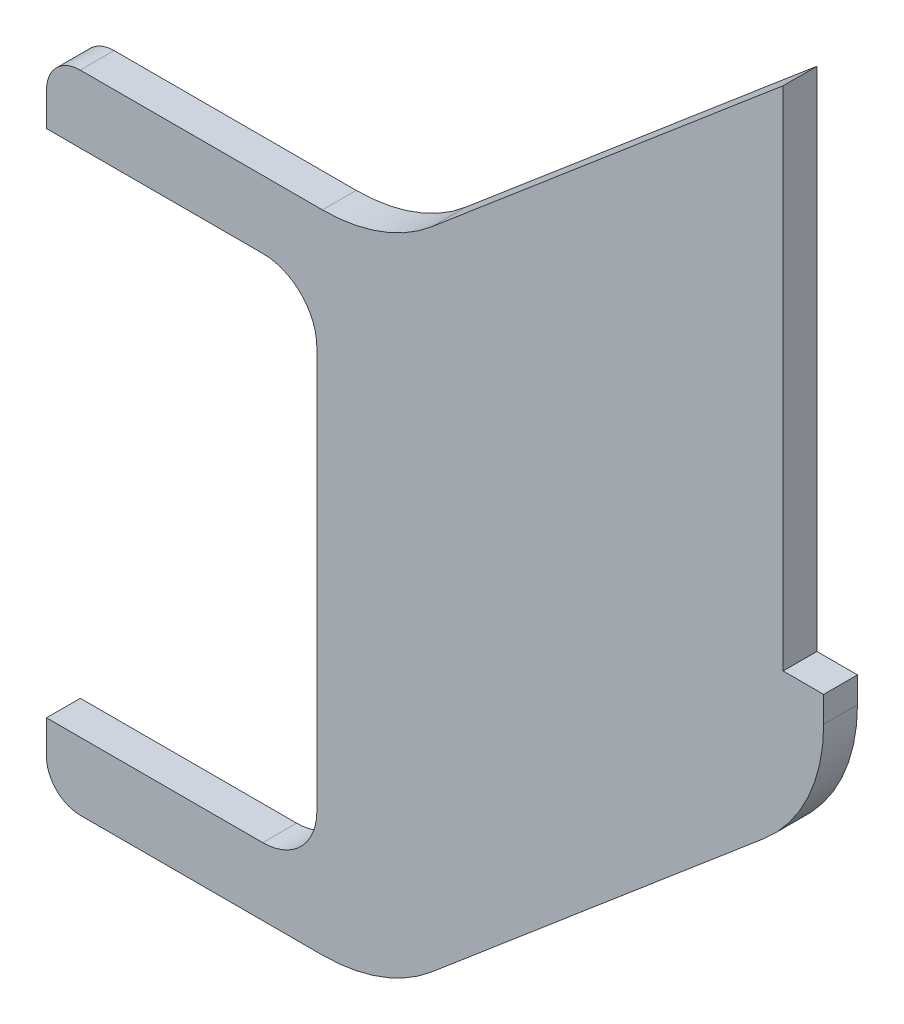
ISO-10303-21;
HEADER;
FILE_DESCRIPTION(('STEP AP214'),'2;1');
FILE_NAME('part.step','',(''),(''),'','','');
FILE_SCHEMA(('AUTOMOTIVE_DESIGN { 1 0 10303 214 1 1 1 1 }'));
ENDSEC;
DATA;
#1=APPLICATION_CONTEXT('core data for automotive mechanical design processes');
#2=APPLICATION_PROTOCOL_DEFINITION('international standard','automotive_design',2000,#1);
#3=PRODUCT_CONTEXT('',#1,'mechanical');
#4=PRODUCT('Part','Part','',(#3));
#5=PRODUCT_RELATED_PRODUCT_CATEGORY('part','',(#4));
#6=PRODUCT_DEFINITION_FORMATION('','',#4);
#7=PRODUCT_DEFINITION_CONTEXT('part definition',#1,'design');
#8=PRODUCT_DEFINITION('design','',#6,#7);
#9=PRODUCT_DEFINITION_SHAPE('','',#8);
#10=(LENGTH_UNIT() NAMED_UNIT(*) SI_UNIT(.MILLI.,.METRE.));
#11=(NAMED_UNIT(*) PLANE_ANGLE_UNIT() SI_UNIT($,.RADIAN.));
#12=(NAMED_UNIT(*) SI_UNIT($,.STERADIAN.) SOLID_ANGLE_UNIT());
#13=UNCERTAINTY_MEASURE_WITH_UNIT(LENGTH_MEASURE(1.E-05),#10,'distance_accuracy_value','');
#14=(GEOMETRIC_REPRESENTATION_CONTEXT(3) GLOBAL_UNCERTAINTY_ASSIGNED_CONTEXT((#13)) GLOBAL_UNIT_ASSIGNED_CONTEXT((#10,
#11,#12)) REPRESENTATION_CONTEXT('',''));
#15=CARTESIAN_POINT('',(0.,0.,0.));
#16=DIRECTION('',(0.,0.,1.));
#17=DIRECTION('',(1.,0.,0.));
#18=AXIS2_PLACEMENT_3D('',#15,#16,#17);
#19=CARTESIAN_POINT('',(0.,171.,10.));
#20=DIRECTION('',(1.,0.,0.));
#21=DIRECTION('',(0.,0.,-1.));
#22=AXIS2_PLACEMENT_3D('',#19,#20,#21);
#23=PLANE('',#22);
#24=DIRECTION('',(0.,-1.,0.));
#25=VECTOR('',#24,1.);
#26=CARTESIAN_POINT('',(0.,171.,10.));
#27=LINE('',#26,#25);
#28=CARTESIAN_POINT('',(0.,181.,10.));
#29=VERTEX_POINT('',#28);
#30=CARTESIAN_POINT('',(0.,171.,10.));
#31=VERTEX_POINT('',#30);
#32=EDGE_CURVE('E168',#29,#31,#27,.T.);
#33=ORIENTED_EDGE('',*,*,#32,.F.);
#34=DIRECTION('',(0.,0.,-1.));
#35=VECTOR('',#34,1.);
#36=CARTESIAN_POINT('',(0.,181.,10.));
#37=LINE('',#36,#35);
#38=CARTESIAN_POINT('',(0.,181.,0.));
#39=VERTEX_POINT('',#38);
#40=EDGE_CURVE('E218',#29,#39,#37,.T.);
#41=ORIENTED_EDGE('',*,*,#40,.T.);
#42=DIRECTION('',(0.,-1.,0.));
#43=VECTOR('',#42,1.);
#44=CARTESIAN_POINT('',(0.,171.,0.));
#45=LINE('',#44,#43);
#46=CARTESIAN_POINT('',(0.,171.,0.));
#47=VERTEX_POINT('',#46);
#48=EDGE_CURVE('E192',#39,#47,#45,.T.);
#49=ORIENTED_EDGE('',*,*,#48,.T.);
#50=DIRECTION('',(0.,0.,-1.));
#51=VECTOR('',#50,1.);
#52=CARTESIAN_POINT('',(0.,171.,10.));
#53=LINE('',#52,#51);
#54=EDGE_CURVE('E186',#31,#47,#53,.T.);
#55=ORIENTED_EDGE('',*,*,#54,.F.);
#56=EDGE_LOOP('',(#33,#41,#49,#55));
#57=FACE_BOUND('',#56,.T.);
#58=ADVANCED_FACE('F34',(#57),#23,.F.);
#59=CARTESIAN_POINT('',(80.,171.,10.));
#60=DIRECTION('',(0.,1.,0.));
#61=DIRECTION('',(0.,0.,1.));
#62=AXIS2_PLACEMENT_3D('',#59,#60,#61);
#63=PLANE('',#62);
#64=DIRECTION('',(1.,0.,0.));
#65=VECTOR('',#64,1.);
#66=CARTESIAN_POINT('',(80.,171.,0.));
#67=LINE('',#66,#65);
#68=CARTESIAN_POINT('',(64.,171.,0.));
#69=VERTEX_POINT('',#68);
#70=EDGE_CURVE('E286',#47,#69,#67,.T.);
#71=ORIENTED_EDGE('',*,*,#70,.T.);
#72=DIRECTION('',(0.,0.,-1.));
#73=VECTOR('',#72,1.);
#74=CARTESIAN_POINT('',(64.,171.,10.));
#75=LINE('',#74,#73);
#76=CARTESIAN_POINT('',(64.,171.,10.));
#77=VERTEX_POINT('',#76);
#78=EDGE_CURVE('E188',#69,#77,#75,.F.);
#79=ORIENTED_EDGE('',*,*,#78,.T.);
#80=DIRECTION('',(1.,0.,0.));
#81=VECTOR('',#80,1.);
#82=CARTESIAN_POINT('',(80.,171.,10.));
#83=LINE('',#82,#81);
#84=EDGE_CURVE('E172',#31,#77,#83,.T.);
#85=ORIENTED_EDGE('',*,*,#84,.F.);
#86=ORIENTED_EDGE('',*,*,#54,.T.);
#87=EDGE_LOOP('',(#71,#79,#85,#86));
#88=FACE_BOUND('',#87,.T.);
#89=ADVANCED_FACE('F185',(#88),#63,.F.);
#90=CARTESIAN_POINT('',(80.,20.,10.));
#91=DIRECTION('',(1.,0.,0.));
#92=DIRECTION('',(0.,0.,-1.));
#93=AXIS2_PLACEMENT_3D('',#90,#91,#92);
#94=PLANE('',#93);
#95=DIRECTION('',(0.,-1.,0.));
#96=VECTOR('',#95,1.);
#97=CARTESIAN_POINT('',(80.,20.,10.));
#98=LINE('',#97,#96);
#99=CARTESIAN_POINT('',(80.,155.,10.));
#100=VERTEX_POINT('',#99);
#101=CARTESIAN_POINT('',(80.,36.,10.));
#102=VERTEX_POINT('',#101);
#103=EDGE_CURVE('E189',#100,#102,#98,.T.);
#104=ORIENTED_EDGE('',*,*,#103,.F.);
#105=DIRECTION('',(0.,0.,-1.));
#106=VECTOR('',#105,1.);
#107=CARTESIAN_POINT('',(80.,155.,0.));
#108=LINE('',#107,#106);
#109=CARTESIAN_POINT('',(80.,155.,0.));
#110=VERTEX_POINT('',#109);
#111=EDGE_CURVE('E197',#100,#110,#108,.T.);
#112=ORIENTED_EDGE('',*,*,#111,.T.);
#113=DIRECTION('',(0.,-1.,0.));
#114=VECTOR('',#113,1.);
#115=CARTESIAN_POINT('',(80.,20.,0.));
#116=LINE('',#115,#114);
#117=CARTESIAN_POINT('',(80.,36.,0.));
#118=VERTEX_POINT('',#117);
#119=EDGE_CURVE('E288',#110,#118,#116,.T.);
#120=ORIENTED_EDGE('',*,*,#119,.T.);
#121=DIRECTION('',(0.,0.,-1.));
#122=VECTOR('',#121,1.);
#123=CARTESIAN_POINT('',(80.,36.,10.));
#124=LINE('',#123,#122);
#125=EDGE_CURVE('E194',#118,#102,#124,.F.);
#126=ORIENTED_EDGE('',*,*,#125,.T.);
#127=EDGE_LOOP('',(#104,#112,#120,#126));
#128=FACE_BOUND('',#127,.T.);
#129=ADVANCED_FACE('F387',(#128),#94,.F.);
#130=CARTESIAN_POINT('',(80.,20.,10.));
#131=DIRECTION('',(0.,-1.,0.));
#132=DIRECTION('',(1.,0.,0.));
#133=AXIS2_PLACEMENT_3D('',#130,#131,#132);
#134=PLANE('',#133);
#135=DIRECTION('',(-1.,0.,0.));
#136=VECTOR('',#135,1.);
#137=CARTESIAN_POINT('',(80.,20.,10.));
#138=LINE('',#137,#136);
#139=CARTESIAN_POINT('',(64.,20.,10.));
#140=VERTEX_POINT('',#139);
#141=CARTESIAN_POINT('',(0.,20.,10.));
#142=VERTEX_POINT('',#141);
#143=EDGE_CURVE('E332',#140,#142,#138,.T.);
#144=ORIENTED_EDGE('',*,*,#143,.F.);
#145=DIRECTION('',(0.,0.,-1.));
#146=VECTOR('',#145,1.);
#147=CARTESIAN_POINT('',(64.,20.,0.));
#148=LINE('',#147,#146);
#149=CARTESIAN_POINT('',(64.,20.,0.));
#150=VERTEX_POINT('',#149);
#151=EDGE_CURVE('E207',#140,#150,#148,.T.);
#152=ORIENTED_EDGE('',*,*,#151,.T.);
#153=DIRECTION('',(-1.,0.,0.));
#154=VECTOR('',#153,1.);
#155=CARTESIAN_POINT('',(80.,20.,0.));
#156=LINE('',#155,#154);
#157=CARTESIAN_POINT('',(0.,20.,0.));
#158=VERTEX_POINT('',#157);
#159=EDGE_CURVE('E291',#150,#158,#156,.T.);
#160=ORIENTED_EDGE('',*,*,#159,.T.);
#161=DIRECTION('',(0.,0.,-1.));
#162=VECTOR('',#161,1.);
#163=CARTESIAN_POINT('',(0.,20.,10.));
#164=LINE('',#163,#162);
#165=EDGE_CURVE('E195',#142,#158,#164,.T.);
#166=ORIENTED_EDGE('',*,*,#165,.F.);
#167=EDGE_LOOP('',(#144,#152,#160,#166));
#168=FACE_BOUND('',#167,.T.);
#169=ADVANCED_FACE('F346',(#168),#134,.F.);
#170=CARTESIAN_POINT('',(0.,20.,10.));
#171=DIRECTION('',(1.,0.,0.));
#172=DIRECTION('',(0.,0.,-1.));
#173=AXIS2_PLACEMENT_3D('',#170,#171,#172);
#174=PLANE('',#173);
#175=DIRECTION('',(0.,-1.,0.));
#176=VECTOR('',#175,1.);
#177=CARTESIAN_POINT('',(0.,20.,0.));
#178=LINE('',#177,#176);
#179=CARTESIAN_POINT('',(0.,10.,0.));
#180=VERTEX_POINT('',#179);
#181=EDGE_CURVE('E293',#158,#180,#178,.T.);
#182=ORIENTED_EDGE('',*,*,#181,.T.);
#183=DIRECTION('',(0.,0.,-1.));
#184=VECTOR('',#183,1.);
#185=CARTESIAN_POINT('',(0.,10.,10.));
#186=LINE('',#185,#184);
#187=CARTESIAN_POINT('',(0.,10.,10.));
#188=VERTEX_POINT('',#187);
#189=EDGE_CURVE('E234',#180,#188,#186,.F.);
#190=ORIENTED_EDGE('',*,*,#189,.T.);
#191=DIRECTION('',(0.,-1.,0.));
#192=VECTOR('',#191,1.);
#193=CARTESIAN_POINT('',(0.,20.,10.));
#194=LINE('',#193,#192);
#195=EDGE_CURVE('E329',#142,#188,#194,.T.);
#196=ORIENTED_EDGE('',*,*,#195,.F.);
#197=ORIENTED_EDGE('',*,*,#165,.T.);
#198=EDGE_LOOP('',(#182,#190,#196,#197));
#199=FACE_BOUND('',#198,.T.);
#200=ADVANCED_FACE('F353',(#199),#174,.F.);
#201=CARTESIAN_POINT('',(0.,0.,10.));
#202=DIRECTION('',(0.,1.,0.));
#203=DIRECTION('',(0.,0.,1.));
#204=AXIS2_PLACEMENT_3D('',#201,#202,#203);
#205=PLANE('',#204);
#206=DIRECTION('',(1.,0.,0.));
#207=VECTOR('',#206,1.);
#208=CARTESIAN_POINT('',(0.,0.,0.));
#209=LINE('',#208,#207);
#210=CARTESIAN_POINT('',(10.,0.,0.));
#211=VERTEX_POINT('',#210);
#212=CARTESIAN_POINT('',(81.6630747960588,0.,0.));
#213=VERTEX_POINT('',#212);
#214=EDGE_CURVE('E296',#211,#213,#209,.T.);
#215=ORIENTED_EDGE('',*,*,#214,.T.);
#216=DIRECTION('',(0.,0.,-1.));
#217=VECTOR('',#216,1.);
#218=CARTESIAN_POINT('',(81.6630747960588,0.,10.));
#219=LINE('',#218,#217);
#220=CARTESIAN_POINT('',(81.6630747960588,0.,10.));
#221=VERTEX_POINT('',#220);
#222=EDGE_CURVE('E57',#213,#221,#219,.F.);
#223=ORIENTED_EDGE('',*,*,#222,.T.);
#224=DIRECTION('',(1.,0.,0.));
#225=VECTOR('',#224,1.);
#226=CARTESIAN_POINT('',(0.,0.,10.));
#227=LINE('',#226,#225);
#228=CARTESIAN_POINT('',(10.,0.,10.));
#229=VERTEX_POINT('',#228);
#230=EDGE_CURVE('E327',#229,#221,#227,.T.);
#231=ORIENTED_EDGE('',*,*,#230,.F.);
#232=DIRECTION('',(0.,0.,-1.));
#233=VECTOR('',#232,1.);
#234=CARTESIAN_POINT('',(10.,0.,10.));
#235=LINE('',#234,#233);
#236=EDGE_CURVE('E231',#229,#211,#235,.T.);
#237=ORIENTED_EDGE('',*,*,#236,.T.);
#238=EDGE_LOOP('',(#215,#223,#231,#237));
#239=FACE_BOUND('',#238,.T.);
#240=ADVANCED_FACE('F360',(#239),#205,.F.);
#241=CARTESIAN_POINT('',(230.,110.169491525424,10.));
#242=DIRECTION('',(-0.646521695401616,0.762895600573906,0.));
#243=DIRECTION('',(-0.762895600573906,-0.646521695401616,0.));
#244=AXIS2_PLACEMENT_3D('',#241,#242,#243);
#245=PLANE('',#244);
#246=DIRECTION('',(0.762895600573906,0.646521695401616,0.));
#247=VECTOR('',#246,1.);
#248=CARTESIAN_POINT('',(230.,110.169491525424,0.));
#249=LINE('',#248,#247);
#250=CARTESIAN_POINT('',(113.98915956614,11.8552199713047,0.));
#251=VERTEX_POINT('',#250);
#252=CARTESIAN_POINT('',(212.326084770081,95.1915972627804,0.));
#253=VERTEX_POINT('',#252);
#254=EDGE_CURVE('E298',#251,#253,#249,.T.);
#255=ORIENTED_EDGE('',*,*,#254,.T.);
#256=DIRECTION('',(0.,0.,-1.));
#257=VECTOR('',#256,1.);
#258=CARTESIAN_POINT('',(212.326084770081,95.1915972627804,10.));
#259=LINE('',#258,#257);
#260=CARTESIAN_POINT('',(212.326084770081,95.1915972627804,10.));
#261=VERTEX_POINT('',#260);
#262=EDGE_CURVE('E246',#253,#261,#259,.F.);
#263=ORIENTED_EDGE('',*,*,#262,.T.);
#264=DIRECTION('',(0.762895600573906,0.646521695401616,0.));
#265=VECTOR('',#264,1.);
#266=CARTESIAN_POINT('',(230.,110.169491525424,10.));
#267=LINE('',#266,#265);
#268=CARTESIAN_POINT('',(113.98915956614,11.8552199713047,10.));
#269=VERTEX_POINT('',#268);
#270=EDGE_CURVE('E325',#269,#261,#267,.T.);
#271=ORIENTED_EDGE('',*,*,#270,.F.);
#272=DIRECTION('',(0.,0.,-1.));
#273=VECTOR('',#272,1.);
#274=CARTESIAN_POINT('',(113.98915956614,11.8552199713047,10.));
#275=LINE('',#274,#273);
#276=EDGE_CURVE('E243',#269,#251,#275,.T.);
#277=ORIENTED_EDGE('',*,*,#276,.T.);
#278=EDGE_LOOP('',(#255,#263,#271,#277));
#279=FACE_BOUND('',#278,.T.);
#280=ADVANCED_FACE('F367',(#279),#245,.F.);
#281=CARTESIAN_POINT('',(230.,110.169491525424,10.));
#282=DIRECTION('',(-1.,0.,0.));
#283=DIRECTION('',(0.,0.,1.));
#284=AXIS2_PLACEMENT_3D('',#281,#282,#283);
#285=PLANE('',#284);
#286=DIRECTION('',(0.,1.,0.));
#287=VECTOR('',#286,1.);
#288=CARTESIAN_POINT('',(230.,110.169491525424,10.));
#289=LINE('',#288,#287);
#290=CARTESIAN_POINT('',(230.,133.336377291476,10.));
#291=VERTEX_POINT('',#290);
#292=CARTESIAN_POINT('',(230.,141.,10.));
#293=VERTEX_POINT('',#292);
#294=EDGE_CURVE('E321',#291,#293,#289,.T.);
#295=ORIENTED_EDGE('',*,*,#294,.F.);
#296=DIRECTION('',(0.,0.,-1.));
#297=VECTOR('',#296,1.);
#298=CARTESIAN_POINT('',(230.,133.336377291476,10.));
#299=LINE('',#298,#297);
#300=CARTESIAN_POINT('',(230.,133.336377291476,0.));
#301=VERTEX_POINT('',#300);
#302=EDGE_CURVE('E236',#291,#301,#299,.T.);
#303=ORIENTED_EDGE('',*,*,#302,.T.);
#304=DIRECTION('',(0.,1.,0.));
#305=VECTOR('',#304,1.);
#306=CARTESIAN_POINT('',(230.,110.169491525424,0.));
#307=LINE('',#306,#305);
#308=CARTESIAN_POINT('',(230.,141.,0.));
#309=VERTEX_POINT('',#308);
#310=EDGE_CURVE('E301',#301,#309,#307,.T.);
#311=ORIENTED_EDGE('',*,*,#310,.T.);
#312=DIRECTION('',(0.,0.,-1.));
#313=VECTOR('',#312,1.);
#314=CARTESIAN_POINT('',(230.,141.,10.));
#315=LINE('',#314,#313);
#316=EDGE_CURVE('E200',#293,#309,#315,.T.);
#317=ORIENTED_EDGE('',*,*,#316,.F.);
#318=EDGE_LOOP('',(#295,#303,#311,#317));
#319=FACE_BOUND('',#318,.T.);
#320=ADVANCED_FACE('F373',(#319),#285,.F.);
#321=CARTESIAN_POINT('',(230.,141.,10.));
#322=DIRECTION('',(0.,-1.,0.));
#323=DIRECTION('',(0.,0.,-1.));
#324=AXIS2_PLACEMENT_3D('',#321,#322,#323);
#325=PLANE('',#324);
#326=DIRECTION('',(-1.,0.,0.));
#327=VECTOR('',#326,1.);
#328=CARTESIAN_POINT('',(230.,141.,0.));
#329=LINE('',#328,#327);
#330=CARTESIAN_POINT('',(218.,141.,0.));
#331=VERTEX_POINT('',#330);
#332=EDGE_CURVE('E303',#309,#331,#329,.T.);
#333=ORIENTED_EDGE('',*,*,#332,.T.);
#334=DIRECTION('',(0.,0.,-1.));
#335=VECTOR('',#334,1.);
#336=CARTESIAN_POINT('',(218.,141.,10.));
#337=LINE('',#336,#335);
#338=CARTESIAN_POINT('',(218.,141.,10.));
#339=VERTEX_POINT('',#338);
#340=EDGE_CURVE('E279',#339,#331,#337,.T.);
#341=ORIENTED_EDGE('',*,*,#340,.F.);
#342=DIRECTION('',(-1.,0.,0.));
#343=VECTOR('',#342,1.);
#344=CARTESIAN_POINT('',(230.,141.,10.));
#345=LINE('',#344,#343);
#346=EDGE_CURVE('E315',#293,#339,#345,.T.);
#347=ORIENTED_EDGE('',*,*,#346,.F.);
#348=ORIENTED_EDGE('',*,*,#316,.T.);
#349=EDGE_LOOP('',(#333,#341,#347,#348));
#350=FACE_BOUND('',#349,.T.);
#351=ADVANCED_FACE('F313',(#350),#325,.F.);
#352=CARTESIAN_POINT('',(218.,141.,10.));
#353=DIRECTION('',(-1.,0.,0.));
#354=DIRECTION('',(0.,0.,1.));
#355=AXIS2_PLACEMENT_3D('',#352,#353,#354);
#356=PLANE('',#355);
#357=DIRECTION('',(0.,1.,0.));
#358=VECTOR('',#357,1.);
#359=CARTESIAN_POINT('',(218.,141.,0.));
#360=LINE('',#359,#358);
#361=CARTESIAN_POINT('',(218.,291.,0.));
#362=VERTEX_POINT('',#361);
#363=EDGE_CURVE('E269',#331,#362,#360,.T.);
#364=ORIENTED_EDGE('',*,*,#363,.T.);
#365=DIRECTION('',(0.,0.,-1.));
#366=VECTOR('',#365,1.);
#367=CARTESIAN_POINT('',(218.,291.,10.));
#368=LINE('',#367,#366);
#369=CARTESIAN_POINT('',(218.,291.,10.));
#370=VERTEX_POINT('',#369);
#371=EDGE_CURVE('E268',#370,#362,#368,.T.);
#372=ORIENTED_EDGE('',*,*,#371,.F.);
#373=DIRECTION('',(0.,1.,0.));
#374=VECTOR('',#373,1.);
#375=CARTESIAN_POINT('',(218.,141.,10.));
#376=LINE('',#375,#374);
#377=EDGE_CURVE('E281',#339,#370,#376,.T.);
#378=ORIENTED_EDGE('',*,*,#377,.F.);
#379=ORIENTED_EDGE('',*,*,#340,.T.);
#380=EDGE_LOOP('',(#364,#372,#378,#379));
#381=FACE_BOUND('',#380,.T.);
#382=ADVANCED_FACE('F319',(#381),#356,.F.);
#383=CARTESIAN_POINT('',(100.,191.,10.));
#384=DIRECTION('',(0.646521695401616,-0.762895600573906,0.));
#385=DIRECTION('',(0.762895600573906,0.646521695401616,0.));
#386=AXIS2_PLACEMENT_3D('',#383,#384,#385);
#387=PLANE('',#386);
#388=DIRECTION('',(-0.762895600573906,-0.646521695401616,0.));
#389=VECTOR('',#388,1.);
#390=CARTESIAN_POINT('',(100.,191.,0.));
#391=LINE('',#390,#389);
#392=CARTESIAN_POINT('',(113.98915956614,202.855219971305,0.));
#393=VERTEX_POINT('',#392);
#394=EDGE_CURVE('E262',#362,#393,#391,.T.);
#395=ORIENTED_EDGE('',*,*,#394,.T.);
#396=DIRECTION('',(0.,0.,-1.));
#397=VECTOR('',#396,1.);
#398=CARTESIAN_POINT('',(113.98915956614,202.855219971305,10.));
#399=LINE('',#398,#397);
#400=CARTESIAN_POINT('',(113.98915956614,202.855219971305,10.));
#401=VERTEX_POINT('',#400);
#402=EDGE_CURVE('E49',#393,#401,#399,.F.);
#403=ORIENTED_EDGE('',*,*,#402,.T.);
#404=DIRECTION('',(-0.762895600573906,-0.646521695401616,0.));
#405=VECTOR('',#404,1.);
#406=CARTESIAN_POINT('',(100.,191.,10.));
#407=LINE('',#406,#405);
#408=EDGE_CURVE('E274',#370,#401,#407,.T.);
#409=ORIENTED_EDGE('',*,*,#408,.F.);
#410=ORIENTED_EDGE('',*,*,#371,.T.);
#411=EDGE_LOOP('',(#395,#403,#409,#410));
#412=FACE_BOUND('',#411,.T.);
#413=ADVANCED_FACE('F266',(#412),#387,.F.);
#414=CARTESIAN_POINT('',(0.,191.,10.));
#415=DIRECTION('',(0.,-1.,0.));
#416=DIRECTION('',(0.,0.,-1.));
#417=AXIS2_PLACEMENT_3D('',#414,#415,#416);
#418=PLANE('',#417);
#419=DIRECTION('',(-1.,0.,0.));
#420=VECTOR('',#419,1.);
#421=CARTESIAN_POINT('',(0.,191.,10.));
#422=LINE('',#421,#420);
#423=CARTESIAN_POINT('',(81.6630747960588,191.,10.));
#424=VERTEX_POINT('',#423);
#425=CARTESIAN_POINT('',(10.,191.,10.));
#426=VERTEX_POINT('',#425);
#427=EDGE_CURVE('E273',#424,#426,#422,.T.);
#428=ORIENTED_EDGE('',*,*,#427,.F.);
#429=DIRECTION('',(0.,0.,-1.));
#430=VECTOR('',#429,1.);
#431=CARTESIAN_POINT('',(81.6630747960588,191.,0.));
#432=LINE('',#431,#430);
#433=CARTESIAN_POINT('',(81.6630747960588,191.,0.));
#434=VERTEX_POINT('',#433);
#435=EDGE_CURVE('E253',#424,#434,#432,.T.);
#436=ORIENTED_EDGE('',*,*,#435,.T.);
#437=DIRECTION('',(-1.,0.,0.));
#438=VECTOR('',#437,1.);
#439=CARTESIAN_POINT('',(0.,191.,0.));
#440=LINE('',#439,#438);
#441=CARTESIAN_POINT('',(10.,191.,0.));
#442=VERTEX_POINT('',#441);
#443=EDGE_CURVE('E180',#434,#442,#440,.T.);
#444=ORIENTED_EDGE('',*,*,#443,.T.);
#445=DIRECTION('',(0.,0.,-1.));
#446=VECTOR('',#445,1.);
#447=CARTESIAN_POINT('',(10.,191.,10.));
#448=LINE('',#447,#446);
#449=EDGE_CURVE('E225',#442,#426,#448,.F.);
#450=ORIENTED_EDGE('',*,*,#449,.T.);
#451=EDGE_LOOP('',(#428,#436,#444,#450));
#452=FACE_BOUND('',#451,.T.);
#453=ADVANCED_FACE('F276',(#452),#418,.F.);
#454=CARTESIAN_POINT('',(0.,0.,10.));
#455=DIRECTION('',(0.,0.,-1.));
#456=DIRECTION('',(-1.,0.,0.));
#457=AXIS2_PLACEMENT_3D('',#454,#455,#456);
#458=PLANE('',#457);
#459=ORIENTED_EDGE('',*,*,#270,.T.);
#460=CARTESIAN_POINT('',(180.,133.336377291476,10.));
#461=DIRECTION('',(0.,0.,-1.));
#462=DIRECTION('',(-1.,0.,0.));
#463=AXIS2_PLACEMENT_3D('',#460,#461,#462);
#464=CIRCLE('',#463,50.);
#465=EDGE_CURVE('E250',#261,#291,#464,.F.);
#466=ORIENTED_EDGE('',*,*,#465,.T.);
#467=ORIENTED_EDGE('',*,*,#294,.T.);
#468=ORIENTED_EDGE('',*,*,#346,.T.);
#469=ORIENTED_EDGE('',*,*,#377,.T.);
#470=ORIENTED_EDGE('',*,*,#408,.T.);
#471=CARTESIAN_POINT('',(81.6630747960588,241.,10.));
#472=DIRECTION('',(0.,0.,-1.));
#473=DIRECTION('',(-1.,0.,0.));
#474=AXIS2_PLACEMENT_3D('',#471,#472,#473);
#475=CIRCLE('',#474,50.);
#476=EDGE_CURVE('E11',#401,#424,#475,.T.);
#477=ORIENTED_EDGE('',*,*,#476,.T.);
#478=ORIENTED_EDGE('',*,*,#427,.T.);
#479=CARTESIAN_POINT('',(10.,181.,10.));
#480=DIRECTION('',(0.,0.,-1.));
#481=DIRECTION('',(-1.,0.,0.));
#482=AXIS2_PLACEMENT_3D('',#479,#480,#481);
#483=CIRCLE('',#482,10.);
#484=EDGE_CURVE('E175',#426,#29,#483,.F.);
#485=ORIENTED_EDGE('',*,*,#484,.T.);
#486=ORIENTED_EDGE('',*,*,#32,.T.);
#487=ORIENTED_EDGE('',*,*,#84,.T.);
#488=CARTESIAN_POINT('',(64.,155.,10.));
#489=DIRECTION('',(0.,0.,-1.));
#490=DIRECTION('',(-1.,0.,0.));
#491=AXIS2_PLACEMENT_3D('',#488,#489,#490);
#492=CIRCLE('',#491,16.);
#493=EDGE_CURVE('E212',#77,#100,#492,.T.);
#494=ORIENTED_EDGE('',*,*,#493,.T.);
#495=ORIENTED_EDGE('',*,*,#103,.T.);
#496=CARTESIAN_POINT('',(64.,36.,10.));
#497=DIRECTION('',(0.,0.,-1.));
#498=DIRECTION('',(-1.,0.,0.));
#499=AXIS2_PLACEMENT_3D('',#496,#497,#498);
#500=CIRCLE('',#499,16.);
#501=EDGE_CURVE('E216',#102,#140,#500,.T.);
#502=ORIENTED_EDGE('',*,*,#501,.T.);
#503=ORIENTED_EDGE('',*,*,#143,.T.);
#504=ORIENTED_EDGE('',*,*,#195,.T.);
#505=CARTESIAN_POINT('',(10.,10.,10.));
#506=DIRECTION('',(0.,0.,-1.));
#507=DIRECTION('',(-1.,0.,0.));
#508=AXIS2_PLACEMENT_3D('',#505,#506,#507);
#509=CIRCLE('',#508,10.);
#510=EDGE_CURVE('E228',#188,#229,#509,.F.);
#511=ORIENTED_EDGE('',*,*,#510,.T.);
#512=ORIENTED_EDGE('',*,*,#230,.T.);
#513=CARTESIAN_POINT('',(81.6630747960588,50.,10.));
#514=DIRECTION('',(0.,0.,-1.));
#515=DIRECTION('',(-1.,0.,0.));
#516=AXIS2_PLACEMENT_3D('',#513,#514,#515);
#517=CIRCLE('',#516,50.);
#518=EDGE_CURVE('E248',#221,#269,#517,.F.);
#519=ORIENTED_EDGE('',*,*,#518,.T.);
#520=EDGE_LOOP('',(#459,#466,#467,#468,#469,#470,#477,#478,#485,#486,#487,#494,#495,#502,#503,
#504,#511,#512,#519));
#521=FACE_BOUND('',#520,.T.);
#522=ADVANCED_FACE('F171',(#521),#458,.F.);
#523=CARTESIAN_POINT('',(0.,0.,0.));
#524=DIRECTION('',(0.,0.,-1.));
#525=DIRECTION('',(-1.,0.,0.));
#526=AXIS2_PLACEMENT_3D('',#523,#524,#525);
#527=PLANE('',#526);
#528=ORIENTED_EDGE('',*,*,#310,.F.);
#529=CARTESIAN_POINT('',(180.,133.336377291476,0.));
#530=DIRECTION('',(0.,0.,-1.));
#531=DIRECTION('',(-1.,0.,0.));
#532=AXIS2_PLACEMENT_3D('',#529,#530,#531);
#533=CIRCLE('',#532,50.);
#534=EDGE_CURVE('E241',#301,#253,#533,.T.);
#535=ORIENTED_EDGE('',*,*,#534,.T.);
#536=ORIENTED_EDGE('',*,*,#254,.F.);
#537=CARTESIAN_POINT('',(81.6630747960588,50.,0.));
#538=DIRECTION('',(0.,0.,-1.));
#539=DIRECTION('',(-1.,0.,0.));
#540=AXIS2_PLACEMENT_3D('',#537,#538,#539);
#541=CIRCLE('',#540,50.);
#542=EDGE_CURVE('E239',#251,#213,#541,.T.);
#543=ORIENTED_EDGE('',*,*,#542,.T.);
#544=ORIENTED_EDGE('',*,*,#214,.F.);
#545=CARTESIAN_POINT('',(10.,10.,0.));
#546=DIRECTION('',(0.,0.,-1.));
#547=DIRECTION('',(-1.,0.,0.));
#548=AXIS2_PLACEMENT_3D('',#545,#546,#547);
#549=CIRCLE('',#548,10.);
#550=EDGE_CURVE('E220',#211,#180,#549,.T.);
#551=ORIENTED_EDGE('',*,*,#550,.T.);
#552=ORIENTED_EDGE('',*,*,#181,.F.);
#553=ORIENTED_EDGE('',*,*,#159,.F.);
#554=CARTESIAN_POINT('',(64.,36.,0.));
#555=DIRECTION('',(0.,0.,-1.));
#556=DIRECTION('',(-1.,0.,0.));
#557=AXIS2_PLACEMENT_3D('',#554,#555,#556);
#558=CIRCLE('',#557,16.);
#559=EDGE_CURVE('E214',#150,#118,#558,.F.);
#560=ORIENTED_EDGE('',*,*,#559,.T.);
#561=ORIENTED_EDGE('',*,*,#119,.F.);
#562=CARTESIAN_POINT('',(64.,155.,0.));
#563=DIRECTION('',(0.,0.,-1.));
#564=DIRECTION('',(-1.,0.,0.));
#565=AXIS2_PLACEMENT_3D('',#562,#563,#564);
#566=CIRCLE('',#565,16.);
#567=EDGE_CURVE('E210',#110,#69,#566,.F.);
#568=ORIENTED_EDGE('',*,*,#567,.T.);
#569=ORIENTED_EDGE('',*,*,#70,.F.);
#570=ORIENTED_EDGE('',*,*,#48,.F.);
#571=CARTESIAN_POINT('',(10.,181.,0.));
#572=DIRECTION('',(0.,0.,-1.));
#573=DIRECTION('',(-1.,0.,0.));
#574=AXIS2_PLACEMENT_3D('',#571,#572,#573);
#575=CIRCLE('',#574,10.);
#576=EDGE_CURVE('E222',#39,#442,#575,.T.);
#577=ORIENTED_EDGE('',*,*,#576,.T.);
#578=ORIENTED_EDGE('',*,*,#443,.F.);
#579=CARTESIAN_POINT('',(81.6630747960588,241.,0.));
#580=DIRECTION('',(0.,0.,-1.));
#581=DIRECTION('',(-1.,0.,0.));
#582=AXIS2_PLACEMENT_3D('',#579,#580,#581);
#583=CIRCLE('',#582,50.);
#584=EDGE_CURVE('E42',#434,#393,#583,.F.);
#585=ORIENTED_EDGE('',*,*,#584,.T.);
#586=ORIENTED_EDGE('',*,*,#394,.F.);
#587=ORIENTED_EDGE('',*,*,#363,.F.);
#588=ORIENTED_EDGE('',*,*,#332,.F.);
#589=EDGE_LOOP('',(#528,#535,#536,#543,#544,#551,#552,#553,#560,#561,#568,#569,#570,#577,#578,
#585,#586,#587,#588));
#590=FACE_BOUND('',#589,.T.);
#591=ADVANCED_FACE('F260',(#590),#527,.T.);
#592=CARTESIAN_POINT('',(64.,155.,10.));
#593=DIRECTION('',(0.,0.,1.));
#594=DIRECTION('',(1.,0.,0.));
#595=AXIS2_PLACEMENT_3D('',#592,#593,#594);
#596=CYLINDRICAL_SURFACE('',#595,16.);
#597=ORIENTED_EDGE('',*,*,#493,.F.);
#598=ORIENTED_EDGE('',*,*,#78,.F.);
#599=ORIENTED_EDGE('',*,*,#567,.F.);
#600=ORIENTED_EDGE('',*,*,#111,.F.);
#601=EDGE_LOOP('',(#597,#598,#599,#600));
#602=FACE_BOUND('',#601,.T.);
#603=ADVANCED_FACE('F391',(#602),#596,.F.);
#604=CARTESIAN_POINT('',(64.,36.,10.));
#605=DIRECTION('',(0.,0.,1.));
#606=DIRECTION('',(1.,0.,0.));
#607=AXIS2_PLACEMENT_3D('',#604,#605,#606);
#608=CYLINDRICAL_SURFACE('',#607,16.);
#609=ORIENTED_EDGE('',*,*,#501,.F.);
#610=ORIENTED_EDGE('',*,*,#125,.F.);
#611=ORIENTED_EDGE('',*,*,#559,.F.);
#612=ORIENTED_EDGE('',*,*,#151,.F.);
#613=EDGE_LOOP('',(#609,#610,#611,#612));
#614=FACE_BOUND('',#613,.T.);
#615=ADVANCED_FACE('F343',(#614),#608,.F.);
#616=CARTESIAN_POINT('',(10.,181.,10.));
#617=DIRECTION('',(0.,0.,-1.));
#618=DIRECTION('',(-1.,0.,0.));
#619=AXIS2_PLACEMENT_3D('',#616,#617,#618);
#620=CYLINDRICAL_SURFACE('',#619,10.);
#621=ORIENTED_EDGE('',*,*,#484,.F.);
#622=ORIENTED_EDGE('',*,*,#449,.F.);
#623=ORIENTED_EDGE('',*,*,#576,.F.);
#624=ORIENTED_EDGE('',*,*,#40,.F.);
#625=EDGE_LOOP('',(#621,#622,#623,#624));
#626=FACE_BOUND('',#625,.T.);
#627=ADVANCED_FACE('F397',(#626),#620,.T.);
#628=CARTESIAN_POINT('',(10.,10.,10.));
#629=DIRECTION('',(0.,0.,-1.));
#630=DIRECTION('',(-1.,0.,0.));
#631=AXIS2_PLACEMENT_3D('',#628,#629,#630);
#632=CYLINDRICAL_SURFACE('',#631,10.);
#633=ORIENTED_EDGE('',*,*,#510,.F.);
#634=ORIENTED_EDGE('',*,*,#189,.F.);
#635=ORIENTED_EDGE('',*,*,#550,.F.);
#636=ORIENTED_EDGE('',*,*,#236,.F.);
#637=EDGE_LOOP('',(#633,#634,#635,#636));
#638=FACE_BOUND('',#637,.T.);
#639=ADVANCED_FACE('F357',(#638),#632,.T.);
#640=CARTESIAN_POINT('',(180.,133.336377291476,10.));
#641=DIRECTION('',(0.,0.,-1.));
#642=DIRECTION('',(-1.,0.,0.));
#643=AXIS2_PLACEMENT_3D('',#640,#641,#642);
#644=CYLINDRICAL_SURFACE('',#643,50.);
#645=ORIENTED_EDGE('',*,*,#465,.F.);
#646=ORIENTED_EDGE('',*,*,#262,.F.);
#647=ORIENTED_EDGE('',*,*,#534,.F.);
#648=ORIENTED_EDGE('',*,*,#302,.F.);
#649=EDGE_LOOP('',(#645,#646,#647,#648));
#650=FACE_BOUND('',#649,.T.);
#651=ADVANCED_FACE('F372',(#650),#644,.T.);
#652=CARTESIAN_POINT('',(81.6630747960588,50.,10.));
#653=DIRECTION('',(0.,0.,-1.));
#654=DIRECTION('',(-1.,0.,0.));
#655=AXIS2_PLACEMENT_3D('',#652,#653,#654);
#656=CYLINDRICAL_SURFACE('',#655,50.);
#657=ORIENTED_EDGE('',*,*,#518,.F.);
#658=ORIENTED_EDGE('',*,*,#222,.F.);
#659=ORIENTED_EDGE('',*,*,#542,.F.);
#660=ORIENTED_EDGE('',*,*,#276,.F.);
#661=EDGE_LOOP('',(#657,#658,#659,#660));
#662=FACE_BOUND('',#661,.T.);
#663=ADVANCED_FACE('F364',(#662),#656,.T.);
#664=CARTESIAN_POINT('',(81.6630747960588,241.,10.));
#665=DIRECTION('',(0.,0.,1.));
#666=DIRECTION('',(1.,0.,0.));
#667=AXIS2_PLACEMENT_3D('',#664,#665,#666);
#668=CYLINDRICAL_SURFACE('',#667,50.);
#669=ORIENTED_EDGE('',*,*,#476,.F.);
#670=ORIENTED_EDGE('',*,*,#402,.F.);
#671=ORIENTED_EDGE('',*,*,#584,.F.);
#672=ORIENTED_EDGE('',*,*,#435,.F.);
#673=EDGE_LOOP('',(#669,#670,#671,#672));
#674=FACE_BOUND('',#673,.T.);
#675=ADVANCED_FACE('F36',(#674),#668,.F.);
#676=CLOSED_SHELL('',(#58,#89,#129,#169,#200,#240,#280,#320,#351,#382,#413,#453,#522,#591,#603,
#615,#627,#639,#651,#663,#675));
#677=MANIFOLD_SOLID_BREP('B2',#676);
#678=ADVANCED_BREP_SHAPE_REPRESENTATION('',(#18,#677),#14);
#679=SHAPE_DEFINITION_REPRESENTATION(#9,#678);
ENDSEC;
END-ISO-10303-21;
